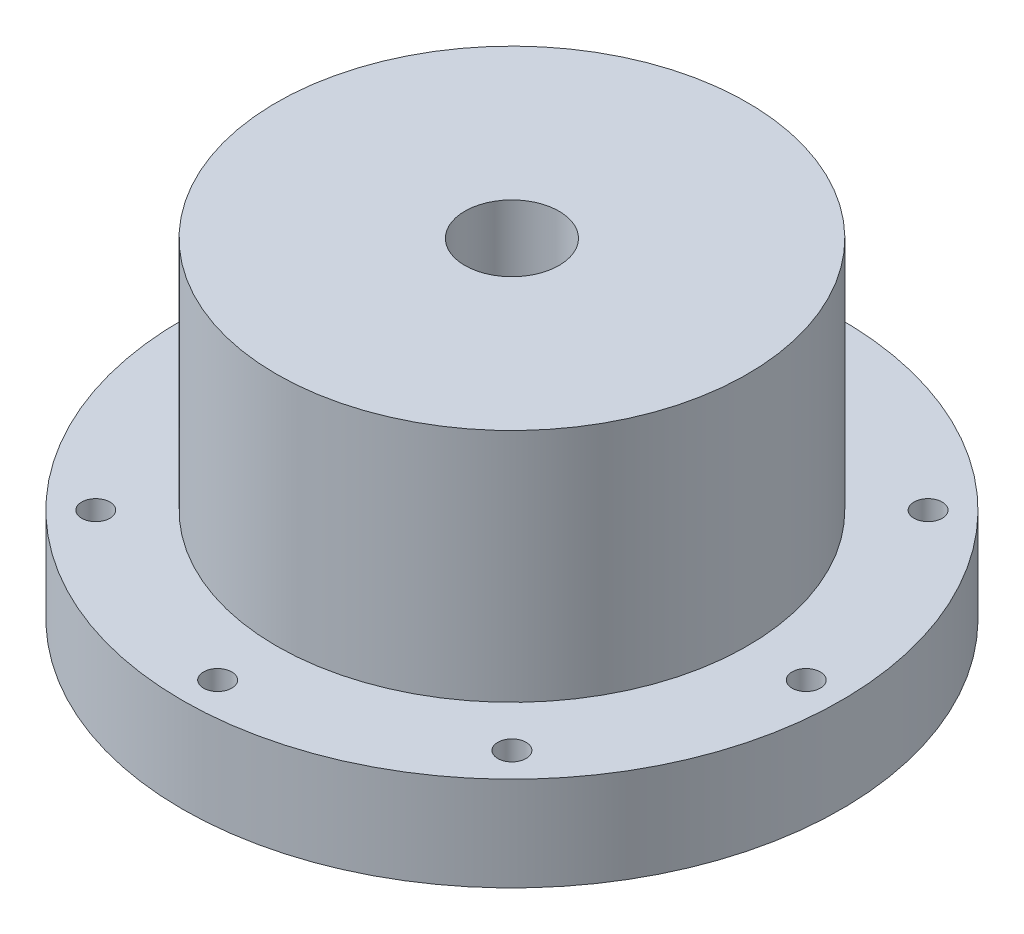
ISO-10303-21;
HEADER;
FILE_DESCRIPTION(('STEP AP214'),'2;1');
FILE_NAME('part.step','',(''),(''),'','','');
FILE_SCHEMA(('AUTOMOTIVE_DESIGN { 1 0 10303 214 1 1 1 1 }'));
ENDSEC;
DATA;
#1=APPLICATION_CONTEXT('core data for automotive mechanical design processes');
#2=APPLICATION_PROTOCOL_DEFINITION('international standard','automotive_design',2000,#1);
#3=PRODUCT_CONTEXT('',#1,'mechanical');
#4=PRODUCT('Part','Part','',(#3));
#5=PRODUCT_RELATED_PRODUCT_CATEGORY('part','',(#4));
#6=PRODUCT_DEFINITION_FORMATION('','',#4);
#7=PRODUCT_DEFINITION_CONTEXT('part definition',#1,'design');
#8=PRODUCT_DEFINITION('design','',#6,#7);
#9=PRODUCT_DEFINITION_SHAPE('','',#8);
#10=(LENGTH_UNIT() NAMED_UNIT(*) SI_UNIT(.MILLI.,.METRE.));
#11=(NAMED_UNIT(*) PLANE_ANGLE_UNIT() SI_UNIT($,.RADIAN.));
#12=(NAMED_UNIT(*) SI_UNIT($,.STERADIAN.) SOLID_ANGLE_UNIT());
#13=UNCERTAINTY_MEASURE_WITH_UNIT(LENGTH_MEASURE(1.E-05),#10,'distance_accuracy_value','');
#14=(GEOMETRIC_REPRESENTATION_CONTEXT(3) GLOBAL_UNCERTAINTY_ASSIGNED_CONTEXT((#13)) GLOBAL_UNIT_ASSIGNED_CONTEXT((#10,
#11,#12)) REPRESENTATION_CONTEXT('',''));
#15=CARTESIAN_POINT('',(0.,0.,0.));
#16=DIRECTION('',(0.,0.,1.));
#17=DIRECTION('',(1.,0.,0.));
#18=AXIS2_PLACEMENT_3D('',#15,#16,#17);
#19=CARTESIAN_POINT('',(0.,20.,0.));
#20=DIRECTION('',(0.,-1.,0.));
#21=DIRECTION('',(0.,0.,-1.));
#22=AXIS2_PLACEMENT_3D('',#19,#20,#21);
#23=CYLINDRICAL_SURFACE('',#22,70.);
#24=CARTESIAN_POINT('',(0.,20.,0.));
#25=DIRECTION('',(0.,1.,0.));
#26=DIRECTION('',(0.,0.,1.));
#27=AXIS2_PLACEMENT_3D('',#24,#25,#26);
#28=CIRCLE('',#27,70.);
#29=CARTESIAN_POINT('',(0.,20.,70.));
#30=VERTEX_POINT('',#29);
#31=EDGE_CURVE('E10',#30,#30,#28,.T.);
#32=ORIENTED_EDGE('',*,*,#31,.F.);
#33=EDGE_LOOP('',(#32));
#34=FACE_BOUND('',#33,.T.);
#35=CARTESIAN_POINT('',(0.,0.,0.));
#36=DIRECTION('',(0.,1.,0.));
#37=DIRECTION('',(0.,0.,1.));
#38=AXIS2_PLACEMENT_3D('',#35,#36,#37);
#39=CIRCLE('',#38,70.);
#40=CARTESIAN_POINT('',(0.,0.,70.));
#41=VERTEX_POINT('',#40);
#42=EDGE_CURVE('E44',#41,#41,#39,.T.);
#43=ORIENTED_EDGE('',*,*,#42,.T.);
#44=EDGE_LOOP('',(#43));
#45=FACE_BOUND('',#44,.T.);
#46=ADVANCED_FACE('F33',(#34,#45),#23,.T.);
#47=CARTESIAN_POINT('',(0.,20.,0.));
#48=DIRECTION('',(0.,-1.,0.));
#49=DIRECTION('',(0.,0.,-1.));
#50=AXIS2_PLACEMENT_3D('',#47,#48,#49);
#51=CYLINDRICAL_SURFACE('',#50,10.);
#52=CARTESIAN_POINT('',(0.,0.,0.));
#53=DIRECTION('',(0.,1.,0.));
#54=DIRECTION('',(0.,0.,1.));
#55=AXIS2_PLACEMENT_3D('',#52,#53,#54);
#56=CIRCLE('',#55,10.);
#57=CARTESIAN_POINT('',(0.,0.,10.));
#58=VERTEX_POINT('',#57);
#59=EDGE_CURVE('E36',#58,#58,#56,.T.);
#60=ORIENTED_EDGE('',*,*,#59,.F.);
#61=EDGE_LOOP('',(#60));
#62=FACE_BOUND('',#61,.T.);
#63=CARTESIAN_POINT('',(0.,70.,0.));
#64=DIRECTION('',(0.,1.,0.));
#65=DIRECTION('',(0.,0.,1.));
#66=AXIS2_PLACEMENT_3D('',#63,#64,#65);
#67=CIRCLE('',#66,10.);
#68=CARTESIAN_POINT('',(0.,70.,10.));
#69=VERTEX_POINT('',#68);
#70=EDGE_CURVE('E56',#69,#69,#67,.T.);
#71=ORIENTED_EDGE('',*,*,#70,.T.);
#72=EDGE_LOOP('',(#71));
#73=FACE_BOUND('',#72,.T.);
#74=ADVANCED_FACE('F125',(#62,#73),#51,.F.);
#75=CARTESIAN_POINT('',(0.,20.,0.));
#76=DIRECTION('',(0.,1.,0.));
#77=DIRECTION('',(0.,0.,1.));
#78=AXIS2_PLACEMENT_3D('',#75,#76,#77);
#79=PLANE('',#78);
#80=CARTESIAN_POINT('',(44.1941738241603,20.,44.1941738241619));
#81=DIRECTION('',(0.,1.,0.));
#82=DIRECTION('',(0.,0.,1.));
#83=AXIS2_PLACEMENT_3D('',#80,#81,#82);
#84=CIRCLE('',#83,3.);
#85=CARTESIAN_POINT('',(44.1941738241603,20.,47.1941738241619));
#86=VERTEX_POINT('',#85);
#87=EDGE_CURVE('E60',#86,#86,#84,.T.);
#88=ORIENTED_EDGE('',*,*,#87,.F.);
#89=EDGE_LOOP('',(#88));
#90=FACE_BOUND('',#89,.T.);
#91=CARTESIAN_POINT('',(62.5000000000038,20.,3.81871415196722E-12));
#92=DIRECTION('',(0.,1.,0.));
#93=DIRECTION('',(0.,0.,1.));
#94=AXIS2_PLACEMENT_3D('',#91,#92,#93);
#95=CIRCLE('',#94,3.00000000000001);
#96=CARTESIAN_POINT('',(62.5000000000038,20.,3.00000000000383));
#97=VERTEX_POINT('',#96);
#98=EDGE_CURVE('E65',#97,#97,#95,.T.);
#99=ORIENTED_EDGE('',*,*,#98,.F.);
#100=EDGE_LOOP('',(#99));
#101=FACE_BOUND('',#100,.T.);
#102=CARTESIAN_POINT('',(44.1941738241657,20.,-44.1941738241565));
#103=DIRECTION('',(0.,1.,0.));
#104=DIRECTION('',(0.,0.,1.));
#105=AXIS2_PLACEMENT_3D('',#102,#103,#104);
#106=CIRCLE('',#105,3.);
#107=CARTESIAN_POINT('',(44.1941738241657,20.,-41.1941738241565));
#108=VERTEX_POINT('',#107);
#109=EDGE_CURVE('E68',#108,#108,#106,.T.);
#110=ORIENTED_EDGE('',*,*,#109,.F.);
#111=EDGE_LOOP('',(#110));
#112=FACE_BOUND('',#111,.T.);
#113=CARTESIAN_POINT('',(-44.1941738241527,20.,-44.1941738241619));
#114=DIRECTION('',(0.,1.,0.));
#115=DIRECTION('',(0.,0.,1.));
#116=AXIS2_PLACEMENT_3D('',#113,#114,#115);
#117=CIRCLE('',#116,3.);
#118=CARTESIAN_POINT('',(-44.1941738241527,20.,-41.1941738241619));
#119=VERTEX_POINT('',#118);
#120=EDGE_CURVE('E71',#119,#119,#117,.T.);
#121=ORIENTED_EDGE('',*,*,#120,.F.);
#122=EDGE_LOOP('',(#121));
#123=FACE_BOUND('',#122,.T.);
#124=CARTESIAN_POINT('',(7.63742830393445E-12,20.,-62.5));
#125=DIRECTION('',(0.,1.,0.));
#126=DIRECTION('',(0.,0.,1.));
#127=AXIS2_PLACEMENT_3D('',#124,#125,#126);
#128=CIRCLE('',#127,3.);
#129=CARTESIAN_POINT('',(7.63742830393445E-12,20.,-59.5));
#130=VERTEX_POINT('',#129);
#131=EDGE_CURVE('E74',#130,#130,#128,.T.);
#132=ORIENTED_EDGE('',*,*,#131,.F.);
#133=EDGE_LOOP('',(#132));
#134=FACE_BOUND('',#133,.T.);
#135=CARTESIAN_POINT('',(-62.4999999999962,20.,-3.8263681944619E-12));
#136=DIRECTION('',(0.,1.,0.));
#137=DIRECTION('',(0.,0.,1.));
#138=AXIS2_PLACEMENT_3D('',#135,#136,#137);
#139=CIRCLE('',#138,3.);
#140=CARTESIAN_POINT('',(-62.4999999999962,20.,2.99999999999618));
#141=VERTEX_POINT('',#140);
#142=EDGE_CURVE('E77',#141,#141,#139,.T.);
#143=ORIENTED_EDGE('',*,*,#142,.F.);
#144=EDGE_LOOP('',(#143));
#145=FACE_BOUND('',#144,.T.);
#146=CARTESIAN_POINT('',(0.,20.,62.5));
#147=DIRECTION('',(0.,1.,0.));
#148=DIRECTION('',(0.,0.,1.));
#149=AXIS2_PLACEMENT_3D('',#146,#147,#148);
#150=CIRCLE('',#149,3.);
#151=CARTESIAN_POINT('',(0.,20.,65.5));
#152=VERTEX_POINT('',#151);
#153=EDGE_CURVE('E80',#152,#152,#150,.T.);
#154=ORIENTED_EDGE('',*,*,#153,.F.);
#155=EDGE_LOOP('',(#154));
#156=FACE_BOUND('',#155,.T.);
#157=CARTESIAN_POINT('',(-44.1941738241581,20.,44.1941738241565));
#158=DIRECTION('',(0.,1.,0.));
#159=DIRECTION('',(0.,0.,1.));
#160=AXIS2_PLACEMENT_3D('',#157,#158,#159);
#161=CIRCLE('',#160,3.);
#162=CARTESIAN_POINT('',(-44.1941738241581,20.,47.1941738241565));
#163=VERTEX_POINT('',#162);
#164=EDGE_CURVE('E83',#163,#163,#161,.T.);
#165=ORIENTED_EDGE('',*,*,#164,.F.);
#166=EDGE_LOOP('',(#165));
#167=FACE_BOUND('',#166,.T.);
#168=CARTESIAN_POINT('',(0.,20.,0.));
#169=DIRECTION('',(0.,1.,0.));
#170=DIRECTION('',(0.,0.,1.));
#171=AXIS2_PLACEMENT_3D('',#168,#169,#170);
#172=CIRCLE('',#171,50.);
#173=CARTESIAN_POINT('',(0.,20.,50.));
#174=VERTEX_POINT('',#173);
#175=EDGE_CURVE('E46',#174,#174,#172,.F.);
#176=ORIENTED_EDGE('',*,*,#175,.T.);
#177=EDGE_LOOP('',(#176));
#178=FACE_BOUND('',#177,.T.);
#179=ORIENTED_EDGE('',*,*,#31,.T.);
#180=EDGE_LOOP('',(#179));
#181=FACE_BOUND('',#180,.T.);
#182=ADVANCED_FACE('F117',(#90,#101,#112,#123,#134,#145,#156,#167,#178,#181),#79,.T.);
#183=CARTESIAN_POINT('',(0.,0.,0.));
#184=DIRECTION('',(0.,1.,0.));
#185=DIRECTION('',(0.,0.,1.));
#186=AXIS2_PLACEMENT_3D('',#183,#184,#185);
#187=PLANE('',#186);
#188=CARTESIAN_POINT('',(44.1941738241603,0.,44.1941738241619));
#189=DIRECTION('',(0.,-1.,0.));
#190=DIRECTION('',(0.,0.,-1.));
#191=AXIS2_PLACEMENT_3D('',#188,#189,#190);
#192=CIRCLE('',#191,3.);
#193=CARTESIAN_POINT('',(44.1941738241603,0.,41.1941738241619));
#194=VERTEX_POINT('',#193);
#195=EDGE_CURVE('E90',#194,#194,#192,.T.);
#196=ORIENTED_EDGE('',*,*,#195,.F.);
#197=EDGE_LOOP('',(#196));
#198=FACE_BOUND('',#197,.T.);
#199=CARTESIAN_POINT('',(62.5000000000038,0.,3.81871415196722E-12));
#200=DIRECTION('',(0.,-1.,0.));
#201=DIRECTION('',(0.,0.,-1.));
#202=AXIS2_PLACEMENT_3D('',#199,#200,#201);
#203=CIRCLE('',#202,3.00000000000001);
#204=CARTESIAN_POINT('',(62.5000000000038,0.,-2.99999999999619));
#205=VERTEX_POINT('',#204);
#206=EDGE_CURVE('E93',#205,#205,#203,.T.);
#207=ORIENTED_EDGE('',*,*,#206,.F.);
#208=EDGE_LOOP('',(#207));
#209=FACE_BOUND('',#208,.T.);
#210=CARTESIAN_POINT('',(44.1941738241657,0.,-44.1941738241565));
#211=DIRECTION('',(0.,-1.,0.));
#212=DIRECTION('',(0.,0.,-1.));
#213=AXIS2_PLACEMENT_3D('',#210,#211,#212);
#214=CIRCLE('',#213,3.);
#215=CARTESIAN_POINT('',(44.1941738241657,0.,-47.1941738241565));
#216=VERTEX_POINT('',#215);
#217=EDGE_CURVE('E96',#216,#216,#214,.T.);
#218=ORIENTED_EDGE('',*,*,#217,.F.);
#219=EDGE_LOOP('',(#218));
#220=FACE_BOUND('',#219,.T.);
#221=CARTESIAN_POINT('',(-44.1941738241527,0.,-44.1941738241619));
#222=DIRECTION('',(0.,-1.,0.));
#223=DIRECTION('',(0.,0.,-1.));
#224=AXIS2_PLACEMENT_3D('',#221,#222,#223);
#225=CIRCLE('',#224,3.);
#226=CARTESIAN_POINT('',(-44.1941738241527,0.,-47.1941738241619));
#227=VERTEX_POINT('',#226);
#228=EDGE_CURVE('E99',#227,#227,#225,.T.);
#229=ORIENTED_EDGE('',*,*,#228,.F.);
#230=EDGE_LOOP('',(#229));
#231=FACE_BOUND('',#230,.T.);
#232=CARTESIAN_POINT('',(7.63742830393445E-12,0.,-62.5));
#233=DIRECTION('',(0.,-1.,0.));
#234=DIRECTION('',(0.,0.,-1.));
#235=AXIS2_PLACEMENT_3D('',#232,#233,#234);
#236=CIRCLE('',#235,3.);
#237=CARTESIAN_POINT('',(7.63742830393445E-12,0.,-65.5));
#238=VERTEX_POINT('',#237);
#239=EDGE_CURVE('E102',#238,#238,#236,.T.);
#240=ORIENTED_EDGE('',*,*,#239,.F.);
#241=EDGE_LOOP('',(#240));
#242=FACE_BOUND('',#241,.T.);
#243=CARTESIAN_POINT('',(-62.4999999999962,0.,-3.8263681944619E-12));
#244=DIRECTION('',(0.,-1.,0.));
#245=DIRECTION('',(0.,0.,-1.));
#246=AXIS2_PLACEMENT_3D('',#243,#244,#245);
#247=CIRCLE('',#246,3.);
#248=CARTESIAN_POINT('',(-62.4999999999962,0.,-3.00000000000383));
#249=VERTEX_POINT('',#248);
#250=EDGE_CURVE('E105',#249,#249,#247,.T.);
#251=ORIENTED_EDGE('',*,*,#250,.F.);
#252=EDGE_LOOP('',(#251));
#253=FACE_BOUND('',#252,.T.);
#254=CARTESIAN_POINT('',(0.,0.,62.5));
#255=DIRECTION('',(0.,-1.,0.));
#256=DIRECTION('',(0.,0.,-1.));
#257=AXIS2_PLACEMENT_3D('',#254,#255,#256);
#258=CIRCLE('',#257,3.);
#259=CARTESIAN_POINT('',(0.,0.,59.5));
#260=VERTEX_POINT('',#259);
#261=EDGE_CURVE('E89',#260,#260,#258,.T.);
#262=ORIENTED_EDGE('',*,*,#261,.F.);
#263=EDGE_LOOP('',(#262));
#264=FACE_BOUND('',#263,.T.);
#265=CARTESIAN_POINT('',(-44.1941738241581,0.,44.1941738241565));
#266=DIRECTION('',(0.,-1.,0.));
#267=DIRECTION('',(0.,0.,-1.));
#268=AXIS2_PLACEMENT_3D('',#265,#266,#267);
#269=CIRCLE('',#268,3.);
#270=CARTESIAN_POINT('',(-44.1941738241581,0.,41.1941738241565));
#271=VERTEX_POINT('',#270);
#272=EDGE_CURVE('E86',#271,#271,#269,.T.);
#273=ORIENTED_EDGE('',*,*,#272,.F.);
#274=EDGE_LOOP('',(#273));
#275=FACE_BOUND('',#274,.T.);
#276=ORIENTED_EDGE('',*,*,#42,.F.);
#277=EDGE_LOOP('',(#276));
#278=FACE_BOUND('',#277,.T.);
#279=ORIENTED_EDGE('',*,*,#59,.T.);
#280=EDGE_LOOP('',(#279));
#281=FACE_BOUND('',#280,.T.);
#282=ADVANCED_FACE('F113',(#198,#209,#220,#231,#242,#253,#264,#275,#278,#281),#187,.F.);
#283=CARTESIAN_POINT('',(0.,70.,0.));
#284=DIRECTION('',(0.,-1.,0.));
#285=DIRECTION('',(0.,0.,-1.));
#286=AXIS2_PLACEMENT_3D('',#283,#284,#285);
#287=CYLINDRICAL_SURFACE('',#286,50.);
#288=ORIENTED_EDGE('',*,*,#175,.F.);
#289=EDGE_LOOP('',(#288));
#290=FACE_BOUND('',#289,.T.);
#291=CARTESIAN_POINT('',(0.,70.,0.));
#292=DIRECTION('',(0.,1.,0.));
#293=DIRECTION('',(0.,0.,1.));
#294=AXIS2_PLACEMENT_3D('',#291,#292,#293);
#295=CIRCLE('',#294,50.);
#296=CARTESIAN_POINT('',(0.,70.,50.));
#297=VERTEX_POINT('',#296);
#298=EDGE_CURVE('E52',#297,#297,#295,.T.);
#299=ORIENTED_EDGE('',*,*,#298,.F.);
#300=EDGE_LOOP('',(#299));
#301=FACE_BOUND('',#300,.T.);
#302=ADVANCED_FACE('F116',(#290,#301),#287,.T.);
#303=CARTESIAN_POINT('',(0.,70.,0.));
#304=DIRECTION('',(0.,1.,0.));
#305=DIRECTION('',(0.,0.,1.));
#306=AXIS2_PLACEMENT_3D('',#303,#304,#305);
#307=PLANE('',#306);
#308=ORIENTED_EDGE('',*,*,#70,.F.);
#309=EDGE_LOOP('',(#308));
#310=FACE_BOUND('',#309,.T.);
#311=ORIENTED_EDGE('',*,*,#298,.T.);
#312=EDGE_LOOP('',(#311));
#313=FACE_BOUND('',#312,.T.);
#314=ADVANCED_FACE('F130',(#310,#313),#307,.T.);
#315=CARTESIAN_POINT('',(-44.1941738241581,70.,44.1941738241565));
#316=DIRECTION('',(0.,-1.,0.));
#317=DIRECTION('',(0.,0.,-1.));
#318=AXIS2_PLACEMENT_3D('',#315,#316,#317);
#319=CYLINDRICAL_SURFACE('',#318,3.);
#320=ORIENTED_EDGE('',*,*,#164,.T.);
#321=EDGE_LOOP('',(#320));
#322=FACE_BOUND('',#321,.T.);
#323=ORIENTED_EDGE('',*,*,#272,.T.);
#324=EDGE_LOOP('',(#323));
#325=FACE_BOUND('',#324,.T.);
#326=ADVANCED_FACE('F132',(#322,#325),#319,.F.);
#327=CARTESIAN_POINT('',(0.,70.,62.5));
#328=DIRECTION('',(0.,-1.,0.));
#329=DIRECTION('',(0.,0.,-1.));
#330=AXIS2_PLACEMENT_3D('',#327,#328,#329);
#331=CYLINDRICAL_SURFACE('',#330,3.);
#332=ORIENTED_EDGE('',*,*,#153,.T.);
#333=EDGE_LOOP('',(#332));
#334=FACE_BOUND('',#333,.T.);
#335=ORIENTED_EDGE('',*,*,#261,.T.);
#336=EDGE_LOOP('',(#335));
#337=FACE_BOUND('',#336,.T.);
#338=ADVANCED_FACE('F111',(#334,#337),#331,.F.);
#339=CARTESIAN_POINT('',(-62.4999999999962,70.,-3.8263681944619E-12));
#340=DIRECTION('',(0.,-1.,0.));
#341=DIRECTION('',(0.,0.,-1.));
#342=AXIS2_PLACEMENT_3D('',#339,#340,#341);
#343=CYLINDRICAL_SURFACE('',#342,3.);
#344=ORIENTED_EDGE('',*,*,#142,.T.);
#345=EDGE_LOOP('',(#344));
#346=FACE_BOUND('',#345,.T.);
#347=ORIENTED_EDGE('',*,*,#250,.T.);
#348=EDGE_LOOP('',(#347));
#349=FACE_BOUND('',#348,.T.);
#350=ADVANCED_FACE('F184',(#346,#349),#343,.F.);
#351=CARTESIAN_POINT('',(7.63742830393445E-12,70.,-62.5));
#352=DIRECTION('',(0.,-1.,0.));
#353=DIRECTION('',(0.,0.,-1.));
#354=AXIS2_PLACEMENT_3D('',#351,#352,#353);
#355=CYLINDRICAL_SURFACE('',#354,3.);
#356=ORIENTED_EDGE('',*,*,#131,.T.);
#357=EDGE_LOOP('',(#356));
#358=FACE_BOUND('',#357,.T.);
#359=ORIENTED_EDGE('',*,*,#239,.T.);
#360=EDGE_LOOP('',(#359));
#361=FACE_BOUND('',#360,.T.);
#362=ADVANCED_FACE('F193',(#358,#361),#355,.F.);
#363=CARTESIAN_POINT('',(-44.1941738241527,70.,-44.1941738241619));
#364=DIRECTION('',(0.,-1.,0.));
#365=DIRECTION('',(0.,0.,-1.));
#366=AXIS2_PLACEMENT_3D('',#363,#364,#365);
#367=CYLINDRICAL_SURFACE('',#366,3.);
#368=ORIENTED_EDGE('',*,*,#120,.T.);
#369=EDGE_LOOP('',(#368));
#370=FACE_BOUND('',#369,.T.);
#371=ORIENTED_EDGE('',*,*,#228,.T.);
#372=EDGE_LOOP('',(#371));
#373=FACE_BOUND('',#372,.T.);
#374=ADVANCED_FACE('F202',(#370,#373),#367,.F.);
#375=CARTESIAN_POINT('',(44.1941738241657,70.,-44.1941738241565));
#376=DIRECTION('',(0.,-1.,0.));
#377=DIRECTION('',(0.,0.,-1.));
#378=AXIS2_PLACEMENT_3D('',#375,#376,#377);
#379=CYLINDRICAL_SURFACE('',#378,3.);
#380=ORIENTED_EDGE('',*,*,#109,.T.);
#381=EDGE_LOOP('',(#380));
#382=FACE_BOUND('',#381,.T.);
#383=ORIENTED_EDGE('',*,*,#217,.T.);
#384=EDGE_LOOP('',(#383));
#385=FACE_BOUND('',#384,.T.);
#386=ADVANCED_FACE('F211',(#382,#385),#379,.F.);
#387=CARTESIAN_POINT('',(62.5000000000038,70.,3.81871415196722E-12));
#388=DIRECTION('',(0.,-1.,0.));
#389=DIRECTION('',(0.,0.,-1.));
#390=AXIS2_PLACEMENT_3D('',#387,#388,#389);
#391=CYLINDRICAL_SURFACE('',#390,3.00000000000001);
#392=ORIENTED_EDGE('',*,*,#98,.T.);
#393=EDGE_LOOP('',(#392));
#394=FACE_BOUND('',#393,.T.);
#395=ORIENTED_EDGE('',*,*,#206,.T.);
#396=EDGE_LOOP('',(#395));
#397=FACE_BOUND('',#396,.T.);
#398=ADVANCED_FACE('F220',(#394,#397),#391,.F.);
#399=CARTESIAN_POINT('',(44.1941738241603,70.,44.1941738241619));
#400=DIRECTION('',(0.,-1.,0.));
#401=DIRECTION('',(0.,0.,-1.));
#402=AXIS2_PLACEMENT_3D('',#399,#400,#401);
#403=CYLINDRICAL_SURFACE('',#402,3.);
#404=ORIENTED_EDGE('',*,*,#87,.T.);
#405=EDGE_LOOP('',(#404));
#406=FACE_BOUND('',#405,.T.);
#407=ORIENTED_EDGE('',*,*,#195,.T.);
#408=EDGE_LOOP('',(#407));
#409=FACE_BOUND('',#408,.T.);
#410=ADVANCED_FACE('F229',(#406,#409),#403,.F.);
#411=CLOSED_SHELL('',(#46,#74,#182,#282,#302,#314,#326,#338,#350,#362,#374,#386,#398,#410));
#412=MANIFOLD_SOLID_BREP('B2',#411);
#413=ADVANCED_BREP_SHAPE_REPRESENTATION('',(#18,#412),#14);
#414=SHAPE_DEFINITION_REPRESENTATION(#9,#413);
ENDSEC;
END-ISO-10303-21;
